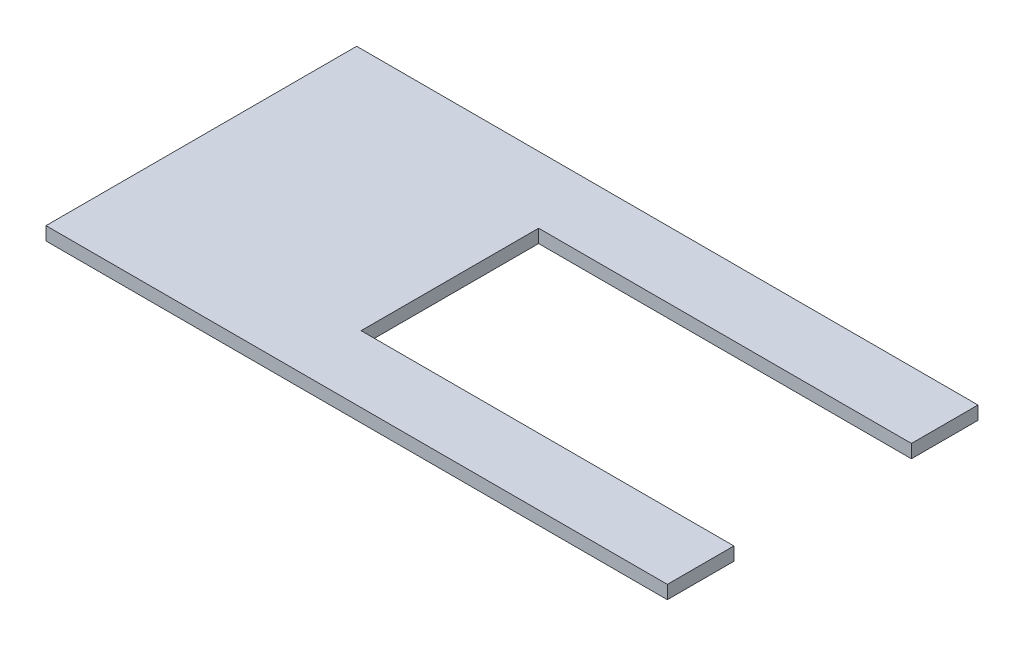
ISO-10303-21;
HEADER;
FILE_DESCRIPTION(('STEP AP214'),'2;1');
FILE_NAME('part.step','',(''),(''),'','','');
FILE_SCHEMA(('AUTOMOTIVE_DESIGN { 1 0 10303 214 1 1 1 1 }'));
ENDSEC;
DATA;
#1=APPLICATION_CONTEXT('core data for automotive mechanical design processes');
#2=APPLICATION_PROTOCOL_DEFINITION('international standard','automotive_design',2000,#1);
#3=PRODUCT_CONTEXT('',#1,'mechanical');
#4=PRODUCT('Part','Part','',(#3));
#5=PRODUCT_RELATED_PRODUCT_CATEGORY('part','',(#4));
#6=PRODUCT_DEFINITION_FORMATION('','',#4);
#7=PRODUCT_DEFINITION_CONTEXT('part definition',#1,'design');
#8=PRODUCT_DEFINITION('design','',#6,#7);
#9=PRODUCT_DEFINITION_SHAPE('','',#8);
#10=(LENGTH_UNIT() NAMED_UNIT(*) SI_UNIT(.MILLI.,.METRE.));
#11=(NAMED_UNIT(*) PLANE_ANGLE_UNIT() SI_UNIT($,.RADIAN.));
#12=(NAMED_UNIT(*) SI_UNIT($,.STERADIAN.) SOLID_ANGLE_UNIT());
#13=UNCERTAINTY_MEASURE_WITH_UNIT(LENGTH_MEASURE(1.E-05),#10,'distance_accuracy_value','');
#14=(GEOMETRIC_REPRESENTATION_CONTEXT(3) GLOBAL_UNCERTAINTY_ASSIGNED_CONTEXT((#13)) GLOBAL_UNIT_ASSIGNED_CONTEXT((#10,
#11,#12)) REPRESENTATION_CONTEXT('',''));
#15=CARTESIAN_POINT('',(0.,0.,0.));
#16=DIRECTION('',(0.,0.,1.));
#17=DIRECTION('',(1.,0.,0.));
#18=AXIS2_PLACEMENT_3D('',#15,#16,#17);
#19=CARTESIAN_POINT('',(-7.,1.5,0.));
#20=DIRECTION('',(-1.,0.,0.));
#21=DIRECTION('',(0.,0.,1.));
#22=AXIS2_PLACEMENT_3D('',#19,#20,#21);
#23=PLANE('',#22);
#24=DIRECTION('',(0.,0.,-1.));
#25=VECTOR('',#24,1.);
#26=CARTESIAN_POINT('',(-7.,0.,0.));
#27=LINE('',#26,#25);
#28=CARTESIAN_POINT('',(-7.,0.,10.));
#29=VERTEX_POINT('',#28);
#30=CARTESIAN_POINT('',(-7.,0.,-10.));
#31=VERTEX_POINT('',#30);
#32=EDGE_CURVE('E195',#29,#31,#27,.T.);
#33=ORIENTED_EDGE('',*,*,#32,.T.);
#34=DIRECTION('',(0.,-1.,0.));
#35=VECTOR('',#34,1.);
#36=CARTESIAN_POINT('',(-7.,1.5,-10.));
#37=LINE('',#36,#35);
#38=CARTESIAN_POINT('',(-7.,1.5,-10.));
#39=VERTEX_POINT('',#38);
#40=EDGE_CURVE('E11',#39,#31,#37,.T.);
#41=ORIENTED_EDGE('',*,*,#40,.F.);
#42=DIRECTION('',(0.,0.,-1.));
#43=VECTOR('',#42,1.);
#44=CARTESIAN_POINT('',(-7.,1.5,0.));
#45=LINE('',#44,#43);
#46=CARTESIAN_POINT('',(-7.,1.5,10.));
#47=VERTEX_POINT('',#46);
#48=EDGE_CURVE('E151',#47,#39,#45,.T.);
#49=ORIENTED_EDGE('',*,*,#48,.F.);
#50=DIRECTION('',(0.,-1.,0.));
#51=VECTOR('',#50,1.);
#52=CARTESIAN_POINT('',(-7.,1.5,10.));
#53=LINE('',#52,#51);
#54=EDGE_CURVE('E58',#47,#29,#53,.T.);
#55=ORIENTED_EDGE('',*,*,#54,.T.);
#56=EDGE_LOOP('',(#33,#41,#49,#55));
#57=FACE_BOUND('',#56,.T.);
#58=ADVANCED_FACE('F41',(#57),#23,.F.);
#59=CARTESIAN_POINT('',(0.,1.5,-10.));
#60=DIRECTION('',(0.,0.,-1.));
#61=DIRECTION('',(-1.,0.,0.));
#62=AXIS2_PLACEMENT_3D('',#59,#60,#61);
#63=PLANE('',#62);
#64=DIRECTION('',(1.,0.,0.));
#65=VECTOR('',#64,1.);
#66=CARTESIAN_POINT('',(0.,0.,-10.));
#67=LINE('',#66,#65);
#68=CARTESIAN_POINT('',(35.,0.,-10.));
#69=VERTEX_POINT('',#68);
#70=EDGE_CURVE('E186',#31,#69,#67,.T.);
#71=ORIENTED_EDGE('',*,*,#70,.T.);
#72=DIRECTION('',(0.,-1.,0.));
#73=VECTOR('',#72,1.);
#74=CARTESIAN_POINT('',(35.,1.5,-10.));
#75=LINE('',#74,#73);
#76=CARTESIAN_POINT('',(35.,1.5,-10.));
#77=VERTEX_POINT('',#76);
#78=EDGE_CURVE('E50',#77,#69,#75,.T.);
#79=ORIENTED_EDGE('',*,*,#78,.F.);
#80=DIRECTION('',(1.,0.,0.));
#81=VECTOR('',#80,1.);
#82=CARTESIAN_POINT('',(0.,1.5,-10.));
#83=LINE('',#82,#81);
#84=EDGE_CURVE('E97',#39,#77,#83,.T.);
#85=ORIENTED_EDGE('',*,*,#84,.F.);
#86=ORIENTED_EDGE('',*,*,#40,.T.);
#87=EDGE_LOOP('',(#71,#79,#85,#86));
#88=FACE_BOUND('',#87,.T.);
#89=ADVANCED_FACE('F212',(#88),#63,.F.);
#90=CARTESIAN_POINT('',(35.,1.5,0.));
#91=DIRECTION('',(-1.,0.,0.));
#92=DIRECTION('',(0.,0.,1.));
#93=AXIS2_PLACEMENT_3D('',#90,#91,#92);
#94=PLANE('',#93);
#95=DIRECTION('',(0.,0.,-1.));
#96=VECTOR('',#95,1.);
#97=CARTESIAN_POINT('',(35.,0.,0.));
#98=LINE('',#97,#96);
#99=CARTESIAN_POINT('',(35.,0.,-17.5));
#100=VERTEX_POINT('',#99);
#101=EDGE_CURVE('E163',#69,#100,#98,.T.);
#102=ORIENTED_EDGE('',*,*,#101,.T.);
#103=DIRECTION('',(0.,-1.,0.));
#104=VECTOR('',#103,1.);
#105=CARTESIAN_POINT('',(35.,1.5,-17.5));
#106=LINE('',#105,#104);
#107=CARTESIAN_POINT('',(35.,1.5,-17.5));
#108=VERTEX_POINT('',#107);
#109=EDGE_CURVE('E176',#108,#100,#106,.T.);
#110=ORIENTED_EDGE('',*,*,#109,.F.);
#111=DIRECTION('',(0.,0.,-1.));
#112=VECTOR('',#111,1.);
#113=CARTESIAN_POINT('',(35.,1.5,0.));
#114=LINE('',#113,#112);
#115=EDGE_CURVE('E139',#77,#108,#114,.T.);
#116=ORIENTED_EDGE('',*,*,#115,.F.);
#117=ORIENTED_EDGE('',*,*,#78,.T.);
#118=EDGE_LOOP('',(#102,#110,#116,#117));
#119=FACE_BOUND('',#118,.T.);
#120=ADVANCED_FACE('F183',(#119),#94,.F.);
#121=CARTESIAN_POINT('',(0.,1.5,-17.5));
#122=DIRECTION('',(0.,0.,-1.));
#123=DIRECTION('',(-1.,0.,0.));
#124=AXIS2_PLACEMENT_3D('',#121,#122,#123);
#125=PLANE('',#124);
#126=DIRECTION('',(1.,0.,0.));
#127=VECTOR('',#126,1.);
#128=CARTESIAN_POINT('',(0.,0.,-17.5));
#129=LINE('',#128,#127);
#130=CARTESIAN_POINT('',(-35.,0.,-17.5));
#131=VERTEX_POINT('',#130);
#132=EDGE_CURVE('E189',#131,#100,#129,.T.);
#133=ORIENTED_EDGE('',*,*,#132,.F.);
#134=DIRECTION('',(0.,-1.,0.));
#135=VECTOR('',#134,1.);
#136=CARTESIAN_POINT('',(-35.,1.5,-17.5));
#137=LINE('',#136,#135);
#138=CARTESIAN_POINT('',(-35.,1.5,-17.5));
#139=VERTEX_POINT('',#138);
#140=EDGE_CURVE('E173',#139,#131,#137,.T.);
#141=ORIENTED_EDGE('',*,*,#140,.F.);
#142=DIRECTION('',(1.,0.,0.));
#143=VECTOR('',#142,1.);
#144=CARTESIAN_POINT('',(0.,1.5,-17.5));
#145=LINE('',#144,#143);
#146=EDGE_CURVE('E145',#139,#108,#145,.T.);
#147=ORIENTED_EDGE('',*,*,#146,.T.);
#148=ORIENTED_EDGE('',*,*,#109,.T.);
#149=EDGE_LOOP('',(#133,#141,#147,#148));
#150=FACE_BOUND('',#149,.T.);
#151=ADVANCED_FACE('F204',(#150),#125,.T.);
#152=CARTESIAN_POINT('',(-35.,1.5,0.));
#153=DIRECTION('',(-1.,0.,0.));
#154=DIRECTION('',(0.,0.,1.));
#155=AXIS2_PLACEMENT_3D('',#152,#153,#154);
#156=PLANE('',#155);
#157=DIRECTION('',(0.,0.,-1.));
#158=VECTOR('',#157,1.);
#159=CARTESIAN_POINT('',(-35.,0.,0.));
#160=LINE('',#159,#158);
#161=CARTESIAN_POINT('',(-35.,0.,17.5));
#162=VERTEX_POINT('',#161);
#163=EDGE_CURVE('E193',#162,#131,#160,.T.);
#164=ORIENTED_EDGE('',*,*,#163,.F.);
#165=DIRECTION('',(0.,-1.,0.));
#166=VECTOR('',#165,1.);
#167=CARTESIAN_POINT('',(-35.,1.5,17.5));
#168=LINE('',#167,#166);
#169=CARTESIAN_POINT('',(-35.,1.5,17.5));
#170=VERTEX_POINT('',#169);
#171=EDGE_CURVE('E133',#170,#162,#168,.T.);
#172=ORIENTED_EDGE('',*,*,#171,.F.);
#173=DIRECTION('',(0.,0.,-1.));
#174=VECTOR('',#173,1.);
#175=CARTESIAN_POINT('',(-35.,1.5,0.));
#176=LINE('',#175,#174);
#177=EDGE_CURVE('E121',#170,#139,#176,.T.);
#178=ORIENTED_EDGE('',*,*,#177,.T.);
#179=ORIENTED_EDGE('',*,*,#140,.T.);
#180=EDGE_LOOP('',(#164,#172,#178,#179));
#181=FACE_BOUND('',#180,.T.);
#182=ADVANCED_FACE('F202',(#181),#156,.T.);
#183=CARTESIAN_POINT('',(0.,1.5,17.5));
#184=DIRECTION('',(0.,0.,-1.));
#185=DIRECTION('',(-1.,0.,0.));
#186=AXIS2_PLACEMENT_3D('',#183,#184,#185);
#187=PLANE('',#186);
#188=DIRECTION('',(1.,0.,0.));
#189=VECTOR('',#188,1.);
#190=CARTESIAN_POINT('',(0.,0.,17.5));
#191=LINE('',#190,#189);
#192=CARTESIAN_POINT('',(35.,0.,17.5));
#193=VERTEX_POINT('',#192);
#194=EDGE_CURVE('E129',#162,#193,#191,.T.);
#195=ORIENTED_EDGE('',*,*,#194,.T.);
#196=DIRECTION('',(0.,-1.,0.));
#197=VECTOR('',#196,1.);
#198=CARTESIAN_POINT('',(35.,1.5,17.5));
#199=LINE('',#198,#197);
#200=CARTESIAN_POINT('',(35.,1.5,17.5));
#201=VERTEX_POINT('',#200);
#202=EDGE_CURVE('E126',#201,#193,#199,.T.);
#203=ORIENTED_EDGE('',*,*,#202,.F.);
#204=DIRECTION('',(1.,0.,0.));
#205=VECTOR('',#204,1.);
#206=CARTESIAN_POINT('',(0.,1.5,17.5));
#207=LINE('',#206,#205);
#208=EDGE_CURVE('E113',#170,#201,#207,.T.);
#209=ORIENTED_EDGE('',*,*,#208,.F.);
#210=ORIENTED_EDGE('',*,*,#171,.T.);
#211=EDGE_LOOP('',(#195,#203,#209,#210));
#212=FACE_BOUND('',#211,.T.);
#213=ADVANCED_FACE('F127',(#212),#187,.F.);
#214=CARTESIAN_POINT('',(35.,0.,10.));
#215=VERTEX_POINT('',#214);
#216=EDGE_CURVE('E158',#193,#215,#98,.T.);
#217=ORIENTED_EDGE('',*,*,#216,.T.);
#218=DIRECTION('',(0.,-1.,0.));
#219=VECTOR('',#218,1.);
#220=CARTESIAN_POINT('',(35.,1.5,10.));
#221=LINE('',#220,#219);
#222=CARTESIAN_POINT('',(35.,1.5,10.));
#223=VERTEX_POINT('',#222);
#224=EDGE_CURVE('E85',#223,#215,#221,.T.);
#225=ORIENTED_EDGE('',*,*,#224,.F.);
#226=EDGE_CURVE('E118',#201,#223,#114,.T.);
#227=ORIENTED_EDGE('',*,*,#226,.F.);
#228=ORIENTED_EDGE('',*,*,#202,.T.);
#229=EDGE_LOOP('',(#217,#225,#227,#228));
#230=FACE_BOUND('',#229,.T.);
#231=ADVANCED_FACE('F135',(#230),#94,.F.);
#232=CARTESIAN_POINT('',(0.,1.5,10.));
#233=DIRECTION('',(0.,0.,-1.));
#234=DIRECTION('',(-1.,0.,0.));
#235=AXIS2_PLACEMENT_3D('',#232,#233,#234);
#236=PLANE('',#235);
#237=DIRECTION('',(1.,0.,0.));
#238=VECTOR('',#237,1.);
#239=CARTESIAN_POINT('',(0.,0.,10.));
#240=LINE('',#239,#238);
#241=EDGE_CURVE('E153',#29,#215,#240,.T.);
#242=ORIENTED_EDGE('',*,*,#241,.F.);
#243=ORIENTED_EDGE('',*,*,#54,.F.);
#244=DIRECTION('',(1.,0.,0.));
#245=VECTOR('',#244,1.);
#246=CARTESIAN_POINT('',(0.,1.5,10.));
#247=LINE('',#246,#245);
#248=EDGE_CURVE('E137',#47,#223,#247,.T.);
#249=ORIENTED_EDGE('',*,*,#248,.T.);
#250=ORIENTED_EDGE('',*,*,#224,.T.);
#251=EDGE_LOOP('',(#242,#243,#249,#250));
#252=FACE_BOUND('',#251,.T.);
#253=ADVANCED_FACE('F221',(#252),#236,.T.);
#254=CARTESIAN_POINT('',(0.,1.5,0.));
#255=DIRECTION('',(0.,1.,0.));
#256=DIRECTION('',(0.,0.,1.));
#257=AXIS2_PLACEMENT_3D('',#254,#255,#256);
#258=PLANE('',#257);
#259=ORIENTED_EDGE('',*,*,#48,.T.);
#260=ORIENTED_EDGE('',*,*,#84,.T.);
#261=ORIENTED_EDGE('',*,*,#115,.T.);
#262=ORIENTED_EDGE('',*,*,#146,.F.);
#263=ORIENTED_EDGE('',*,*,#177,.F.);
#264=ORIENTED_EDGE('',*,*,#208,.T.);
#265=ORIENTED_EDGE('',*,*,#226,.T.);
#266=ORIENTED_EDGE('',*,*,#248,.F.);
#267=EDGE_LOOP('',(#259,#260,#261,#262,#263,#264,#265,#266));
#268=FACE_BOUND('',#267,.T.);
#269=ADVANCED_FACE('F115',(#268),#258,.T.);
#270=CARTESIAN_POINT('',(0.,0.,0.));
#271=DIRECTION('',(0.,1.,0.));
#272=DIRECTION('',(0.,0.,1.));
#273=AXIS2_PLACEMENT_3D('',#270,#271,#272);
#274=PLANE('',#273);
#275=ORIENTED_EDGE('',*,*,#32,.F.);
#276=ORIENTED_EDGE('',*,*,#241,.T.);
#277=ORIENTED_EDGE('',*,*,#216,.F.);
#278=ORIENTED_EDGE('',*,*,#194,.F.);
#279=ORIENTED_EDGE('',*,*,#163,.T.);
#280=ORIENTED_EDGE('',*,*,#132,.T.);
#281=ORIENTED_EDGE('',*,*,#101,.F.);
#282=ORIENTED_EDGE('',*,*,#70,.F.);
#283=EDGE_LOOP('',(#275,#276,#277,#278,#279,#280,#281,#282));
#284=FACE_BOUND('',#283,.T.);
#285=ADVANCED_FACE('F185',(#284),#274,.F.);
#286=CLOSED_SHELL('',(#58,#89,#120,#151,#182,#213,#231,#253,#269,#285));
#287=MANIFOLD_SOLID_BREP('B2',#286);
#288=ADVANCED_BREP_SHAPE_REPRESENTATION('',(#18,#287),#14);
#289=SHAPE_DEFINITION_REPRESENTATION(#9,#288);
ENDSEC;
END-ISO-10303-21;
